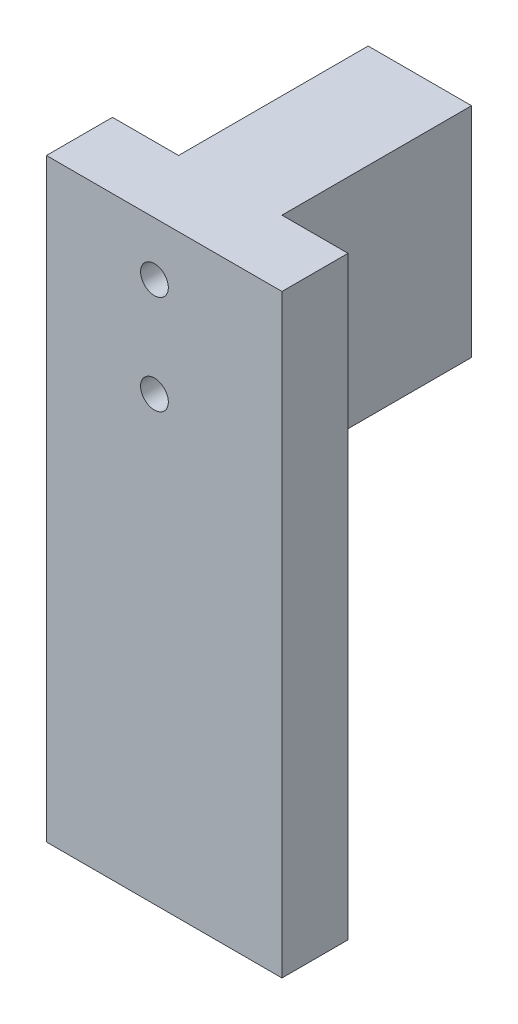
ISO-10303-21;
HEADER;
FILE_DESCRIPTION(('STEP AP214'),'2;1');
FILE_NAME('part.step','',(''),(''),'','','');
FILE_SCHEMA(('AUTOMOTIVE_DESIGN { 1 0 10303 214 1 1 1 1 }'));
ENDSEC;
DATA;
#1=APPLICATION_CONTEXT('core data for automotive mechanical design processes');
#2=APPLICATION_PROTOCOL_DEFINITION('international standard','automotive_design',2000,#1);
#3=PRODUCT_CONTEXT('',#1,'mechanical');
#4=PRODUCT('Part','Part','',(#3));
#5=PRODUCT_RELATED_PRODUCT_CATEGORY('part','',(#4));
#6=PRODUCT_DEFINITION_FORMATION('','',#4);
#7=PRODUCT_DEFINITION_CONTEXT('part definition',#1,'design');
#8=PRODUCT_DEFINITION('design','',#6,#7);
#9=PRODUCT_DEFINITION_SHAPE('','',#8);
#10=(LENGTH_UNIT() NAMED_UNIT(*) SI_UNIT(.MILLI.,.METRE.));
#11=(NAMED_UNIT(*) PLANE_ANGLE_UNIT() SI_UNIT($,.RADIAN.));
#12=(NAMED_UNIT(*) SI_UNIT($,.STERADIAN.) SOLID_ANGLE_UNIT());
#13=UNCERTAINTY_MEASURE_WITH_UNIT(LENGTH_MEASURE(1.E-05),#10,'distance_accuracy_value','');
#14=(GEOMETRIC_REPRESENTATION_CONTEXT(3) GLOBAL_UNCERTAINTY_ASSIGNED_CONTEXT((#13)) GLOBAL_UNIT_ASSIGNED_CONTEXT((#10,
#11,#12)) REPRESENTATION_CONTEXT('',''));
#15=CARTESIAN_POINT('',(0.,0.,0.));
#16=DIRECTION('',(0.,0.,1.));
#17=DIRECTION('',(1.,0.,0.));
#18=AXIS2_PLACEMENT_3D('',#15,#16,#17);
#19=CARTESIAN_POINT('',(0.,0.,0.));
#20=DIRECTION('',(0.,-1.,0.));
#21=DIRECTION('',(0.,0.,-1.));
#22=AXIS2_PLACEMENT_3D('',#19,#20,#21);
#23=PLANE('',#22);
#24=DIRECTION('',(0.,0.,1.));
#25=VECTOR('',#24,1.);
#26=CARTESIAN_POINT('',(3.04832781597487,0.,0.));
#27=LINE('',#26,#25);
#28=CARTESIAN_POINT('',(3.04832781597487,0.,-18.7));
#29=VERTEX_POINT('',#28);
#30=CARTESIAN_POINT('',(3.04832781597487,0.,-15.7));
#31=VERTEX_POINT('',#30);
#32=EDGE_CURVE('E193',#29,#31,#27,.T.);
#33=ORIENTED_EDGE('',*,*,#32,.F.);
#34=DIRECTION('',(-1.,0.,0.));
#35=VECTOR('',#34,1.);
#36=CARTESIAN_POINT('',(18.7,0.,-18.7));
#37=LINE('',#36,#35);
#38=CARTESIAN_POINT('',(18.7,0.,-18.7));
#39=VERTEX_POINT('',#38);
#40=EDGE_CURVE('E48',#39,#29,#37,.T.);
#41=ORIENTED_EDGE('',*,*,#40,.F.);
#42=DIRECTION('',(0.,0.,-1.));
#43=VECTOR('',#42,1.);
#44=CARTESIAN_POINT('',(18.7,0.,-18.7));
#45=LINE('',#44,#43);
#46=CARTESIAN_POINT('',(18.7,0.,10.));
#47=VERTEX_POINT('',#46);
#48=EDGE_CURVE('E237',#47,#39,#45,.T.);
#49=ORIENTED_EDGE('',*,*,#48,.F.);
#50=DIRECTION('',(1.,0.,0.));
#51=VECTOR('',#50,1.);
#52=CARTESIAN_POINT('',(3.04832781597487,0.,10.));
#53=LINE('',#52,#51);
#54=CARTESIAN_POINT('',(3.04832781597487,0.,10.));
#55=VERTEX_POINT('',#54);
#56=EDGE_CURVE('E175',#55,#47,#53,.T.);
#57=ORIENTED_EDGE('',*,*,#56,.F.);
#58=CARTESIAN_POINT('',(3.04832781597487,0.,-3.));
#59=VERTEX_POINT('',#58);
#60=EDGE_CURVE('E188',#59,#55,#27,.T.);
#61=ORIENTED_EDGE('',*,*,#60,.F.);
#62=DIRECTION('',(1.,0.,0.));
#63=VECTOR('',#62,1.);
#64=CARTESIAN_POINT('',(3.,0.,-3.));
#65=LINE('',#64,#63);
#66=CARTESIAN_POINT('',(15.7,0.,-3.));
#67=VERTEX_POINT('',#66);
#68=EDGE_CURVE('E74',#59,#67,#65,.T.);
#69=ORIENTED_EDGE('',*,*,#68,.T.);
#70=DIRECTION('',(0.,0.,-1.));
#71=VECTOR('',#70,1.);
#72=CARTESIAN_POINT('',(15.7,0.,-3.));
#73=LINE('',#72,#71);
#74=CARTESIAN_POINT('',(15.7,0.,-15.7));
#75=VERTEX_POINT('',#74);
#76=EDGE_CURVE('E226',#67,#75,#73,.T.);
#77=ORIENTED_EDGE('',*,*,#76,.T.);
#78=DIRECTION('',(-1.,0.,0.));
#79=VECTOR('',#78,1.);
#80=CARTESIAN_POINT('',(3.,0.,-15.7));
#81=LINE('',#80,#79);
#82=EDGE_CURVE('E217',#75,#31,#81,.T.);
#83=ORIENTED_EDGE('',*,*,#82,.T.);
#84=EDGE_LOOP('',(#33,#41,#49,#57,#61,#69,#77,#83));
#85=FACE_BOUND('',#84,.T.);
#86=ADVANCED_FACE('F39',(#85),#23,.T.);
#87=CARTESIAN_POINT('',(18.7,30.,-18.7));
#88=DIRECTION('',(-1.,0.,0.));
#89=DIRECTION('',(0.,0.,1.));
#90=AXIS2_PLACEMENT_3D('',#87,#88,#89);
#91=PLANE('',#90);
#92=ORIENTED_EDGE('',*,*,#48,.T.);
#93=DIRECTION('',(0.,-1.,0.));
#94=VECTOR('',#93,1.);
#95=CARTESIAN_POINT('',(18.7,30.,-18.7));
#96=LINE('',#95,#94);
#97=CARTESIAN_POINT('',(18.7,33.,-18.7));
#98=VERTEX_POINT('',#97);
#99=EDGE_CURVE('E11',#98,#39,#96,.T.);
#100=ORIENTED_EDGE('',*,*,#99,.F.);
#101=DIRECTION('',(0.,0.,-1.));
#102=VECTOR('',#101,1.);
#103=CARTESIAN_POINT('',(18.7,33.,-18.7));
#104=LINE('',#103,#102);
#105=CARTESIAN_POINT('',(18.7,33.,10.));
#106=VERTEX_POINT('',#105);
#107=EDGE_CURVE('E207',#106,#98,#104,.T.);
#108=ORIENTED_EDGE('',*,*,#107,.F.);
#109=DIRECTION('',(0.,1.,0.));
#110=VECTOR('',#109,1.);
#111=CARTESIAN_POINT('',(18.7,33.,10.));
#112=LINE('',#111,#110);
#113=EDGE_CURVE('E184',#47,#106,#112,.T.);
#114=ORIENTED_EDGE('',*,*,#113,.F.);
#115=EDGE_LOOP('',(#92,#100,#108,#114));
#116=FACE_BOUND('',#115,.T.);
#117=ADVANCED_FACE('F41',(#116),#91,.F.);
#118=CARTESIAN_POINT('',(18.7,30.,-18.7));
#119=DIRECTION('',(0.,0.,1.));
#120=DIRECTION('',(1.,0.,0.));
#121=AXIS2_PLACEMENT_3D('',#118,#119,#120);
#122=PLANE('',#121);
#123=CARTESIAN_POINT('',(9.39832781597487,24.9,-18.7));
#124=DIRECTION('',(0.,0.,-1.));
#125=DIRECTION('',(-1.,0.,0.));
#126=AXIS2_PLACEMENT_3D('',#123,#124,#125);
#127=CIRCLE('',#126,2.1);
#128=CARTESIAN_POINT('',(7.29832781597488,24.9,-18.7));
#129=VERTEX_POINT('',#128);
#130=EDGE_CURVE('E293',#129,#129,#127,.T.);
#131=ORIENTED_EDGE('',*,*,#130,.F.);
#132=EDGE_LOOP('',(#131));
#133=FACE_BOUND('',#132,.T.);
#134=CARTESIAN_POINT('',(9.39832781597487,9.9,-18.7));
#135=DIRECTION('',(0.,0.,-1.));
#136=DIRECTION('',(-1.,0.,0.));
#137=AXIS2_PLACEMENT_3D('',#134,#135,#136);
#138=CIRCLE('',#137,2.1);
#139=CARTESIAN_POINT('',(7.29832781597488,9.9,-18.7));
#140=VERTEX_POINT('',#139);
#141=EDGE_CURVE('E296',#140,#140,#138,.T.);
#142=ORIENTED_EDGE('',*,*,#141,.F.);
#143=EDGE_LOOP('',(#142));
#144=FACE_BOUND('',#143,.T.);
#145=ORIENTED_EDGE('',*,*,#40,.T.);
#146=DIRECTION('',(0.,-1.,0.));
#147=VECTOR('',#146,1.);
#148=CARTESIAN_POINT('',(3.04832781597487,33.,-18.7));
#149=LINE('',#148,#147);
#150=CARTESIAN_POINT('',(3.04832781597487,33.,-18.7));
#151=VERTEX_POINT('',#150);
#152=EDGE_CURVE('E192',#151,#29,#149,.T.);
#153=ORIENTED_EDGE('',*,*,#152,.F.);
#154=DIRECTION('',(-1.,0.,0.));
#155=VECTOR('',#154,1.);
#156=CARTESIAN_POINT('',(0.,33.,-18.7));
#157=LINE('',#156,#155);
#158=EDGE_CURVE('E210',#98,#151,#157,.T.);
#159=ORIENTED_EDGE('',*,*,#158,.F.);
#160=ORIENTED_EDGE('',*,*,#99,.T.);
#161=EDGE_LOOP('',(#145,#153,#159,#160));
#162=FACE_BOUND('',#161,.T.);
#163=ADVANCED_FACE('F242',(#133,#144,#162),#122,.F.);
#164=CARTESIAN_POINT('',(3.,30.,-3.));
#165=DIRECTION('',(0.,0.,-1.));
#166=DIRECTION('',(-1.,0.,0.));
#167=AXIS2_PLACEMENT_3D('',#164,#165,#166);
#168=PLANE('',#167);
#169=CARTESIAN_POINT('',(9.39832781597487,24.9,-3.));
#170=DIRECTION('',(0.,0.,-1.));
#171=DIRECTION('',(-1.,0.,0.));
#172=AXIS2_PLACEMENT_3D('',#169,#170,#171);
#173=CIRCLE('',#172,2.1);
#174=CARTESIAN_POINT('',(7.29832781597488,24.9,-3.));
#175=VERTEX_POINT('',#174);
#176=EDGE_CURVE('E308',#175,#175,#173,.T.);
#177=ORIENTED_EDGE('',*,*,#176,.F.);
#178=EDGE_LOOP('',(#177));
#179=FACE_BOUND('',#178,.T.);
#180=CARTESIAN_POINT('',(9.39832781597487,9.9,-3.));
#181=DIRECTION('',(0.,0.,-1.));
#182=DIRECTION('',(-1.,0.,0.));
#183=AXIS2_PLACEMENT_3D('',#180,#181,#182);
#184=CIRCLE('',#183,2.1);
#185=CARTESIAN_POINT('',(7.29832781597488,9.9,-3.));
#186=VERTEX_POINT('',#185);
#187=EDGE_CURVE('E305',#186,#186,#184,.T.);
#188=ORIENTED_EDGE('',*,*,#187,.F.);
#189=EDGE_LOOP('',(#188));
#190=FACE_BOUND('',#189,.T.);
#191=DIRECTION('',(0.,-1.,0.));
#192=VECTOR('',#191,1.);
#193=CARTESIAN_POINT('',(3.04832781597487,30.,-3.));
#194=LINE('',#193,#192);
#195=CARTESIAN_POINT('',(3.04832781597487,30.,-3.));
#196=VERTEX_POINT('',#195);
#197=EDGE_CURVE('E204',#196,#59,#194,.T.);
#198=ORIENTED_EDGE('',*,*,#197,.F.);
#199=DIRECTION('',(1.,0.,0.));
#200=VECTOR('',#199,1.);
#201=CARTESIAN_POINT('',(3.,30.,-3.));
#202=LINE('',#201,#200);
#203=CARTESIAN_POINT('',(15.7,30.,-3.));
#204=VERTEX_POINT('',#203);
#205=EDGE_CURVE('E62',#196,#204,#202,.T.);
#206=ORIENTED_EDGE('',*,*,#205,.T.);
#207=DIRECTION('',(0.,-1.,0.));
#208=VECTOR('',#207,1.);
#209=CARTESIAN_POINT('',(15.7,30.,-3.));
#210=LINE('',#209,#208);
#211=EDGE_CURVE('E234',#204,#67,#210,.T.);
#212=ORIENTED_EDGE('',*,*,#211,.T.);
#213=ORIENTED_EDGE('',*,*,#68,.F.);
#214=EDGE_LOOP('',(#198,#206,#212,#213));
#215=FACE_BOUND('',#214,.T.);
#216=ADVANCED_FACE('F254',(#179,#190,#215),#168,.T.);
#217=CARTESIAN_POINT('',(15.7,30.,-3.));
#218=DIRECTION('',(-1.,0.,0.));
#219=DIRECTION('',(0.,0.,1.));
#220=AXIS2_PLACEMENT_3D('',#217,#218,#219);
#221=PLANE('',#220);
#222=ORIENTED_EDGE('',*,*,#76,.F.);
#223=ORIENTED_EDGE('',*,*,#211,.F.);
#224=DIRECTION('',(0.,0.,-1.));
#225=VECTOR('',#224,1.);
#226=CARTESIAN_POINT('',(15.7,30.,-3.));
#227=LINE('',#226,#225);
#228=CARTESIAN_POINT('',(15.7,30.,-15.7));
#229=VERTEX_POINT('',#228);
#230=EDGE_CURVE('E216',#204,#229,#227,.T.);
#231=ORIENTED_EDGE('',*,*,#230,.T.);
#232=DIRECTION('',(0.,-1.,0.));
#233=VECTOR('',#232,1.);
#234=CARTESIAN_POINT('',(15.7,30.,-15.7));
#235=LINE('',#234,#233);
#236=EDGE_CURVE('E223',#229,#75,#235,.T.);
#237=ORIENTED_EDGE('',*,*,#236,.T.);
#238=EDGE_LOOP('',(#222,#223,#231,#237));
#239=FACE_BOUND('',#238,.T.);
#240=ADVANCED_FACE('F259',(#239),#221,.T.);
#241=CARTESIAN_POINT('',(3.,30.,-15.7));
#242=DIRECTION('',(0.,0.,1.));
#243=DIRECTION('',(1.,0.,0.));
#244=AXIS2_PLACEMENT_3D('',#241,#242,#243);
#245=PLANE('',#244);
#246=CARTESIAN_POINT('',(9.39832781597487,24.9,-15.7));
#247=DIRECTION('',(0.,0.,1.));
#248=DIRECTION('',(1.,0.,0.));
#249=AXIS2_PLACEMENT_3D('',#246,#247,#248);
#250=CIRCLE('',#249,2.1);
#251=CARTESIAN_POINT('',(11.4983278159749,24.9,-15.7));
#252=VERTEX_POINT('',#251);
#253=EDGE_CURVE('E300',#252,#252,#250,.T.);
#254=ORIENTED_EDGE('',*,*,#253,.F.);
#255=EDGE_LOOP('',(#254));
#256=FACE_BOUND('',#255,.T.);
#257=CARTESIAN_POINT('',(9.39832781597487,9.9,-15.7));
#258=DIRECTION('',(0.,0.,1.));
#259=DIRECTION('',(1.,0.,0.));
#260=AXIS2_PLACEMENT_3D('',#257,#258,#259);
#261=CIRCLE('',#260,2.1);
#262=CARTESIAN_POINT('',(11.4983278159749,9.9,-15.7));
#263=VERTEX_POINT('',#262);
#264=EDGE_CURVE('E315',#263,#263,#261,.T.);
#265=ORIENTED_EDGE('',*,*,#264,.F.);
#266=EDGE_LOOP('',(#265));
#267=FACE_BOUND('',#266,.T.);
#268=DIRECTION('',(0.,1.,0.));
#269=VECTOR('',#268,1.);
#270=CARTESIAN_POINT('',(3.04832781597487,30.,-15.7));
#271=LINE('',#270,#269);
#272=CARTESIAN_POINT('',(3.04832781597487,30.,-15.7));
#273=VERTEX_POINT('',#272);
#274=EDGE_CURVE('E201',#31,#273,#271,.T.);
#275=ORIENTED_EDGE('',*,*,#274,.F.);
#276=ORIENTED_EDGE('',*,*,#82,.F.);
#277=ORIENTED_EDGE('',*,*,#236,.F.);
#278=DIRECTION('',(-1.,0.,0.));
#279=VECTOR('',#278,1.);
#280=CARTESIAN_POINT('',(3.,30.,-15.7));
#281=LINE('',#280,#279);
#282=EDGE_CURVE('E80',#229,#273,#281,.T.);
#283=ORIENTED_EDGE('',*,*,#282,.T.);
#284=EDGE_LOOP('',(#275,#276,#277,#283));
#285=FACE_BOUND('',#284,.T.);
#286=ADVANCED_FACE('F263',(#256,#267,#285),#245,.T.);
#287=CARTESIAN_POINT('',(0.,30.,0.));
#288=DIRECTION('',(0.,1.,0.));
#289=DIRECTION('',(0.,0.,1.));
#290=AXIS2_PLACEMENT_3D('',#287,#288,#289);
#291=PLANE('',#290);
#292=ORIENTED_EDGE('',*,*,#205,.F.);
#293=DIRECTION('',(0.,0.,-1.));
#294=VECTOR('',#293,1.);
#295=CARTESIAN_POINT('',(3.04832781597487,30.,0.));
#296=LINE('',#295,#294);
#297=EDGE_CURVE('E198',#196,#273,#296,.T.);
#298=ORIENTED_EDGE('',*,*,#297,.T.);
#299=ORIENTED_EDGE('',*,*,#282,.F.);
#300=ORIENTED_EDGE('',*,*,#230,.F.);
#301=EDGE_LOOP('',(#292,#298,#299,#300));
#302=FACE_BOUND('',#301,.T.);
#303=ADVANCED_FACE('F255',(#302),#291,.F.);
#304=CARTESIAN_POINT('',(0.,33.,0.));
#305=DIRECTION('',(0.,1.,0.));
#306=DIRECTION('',(0.,0.,1.));
#307=AXIS2_PLACEMENT_3D('',#304,#305,#306);
#308=PLANE('',#307);
#309=DIRECTION('',(0.,0.,1.));
#310=VECTOR('',#309,1.);
#311=CARTESIAN_POINT('',(3.04832781597487,33.,0.));
#312=LINE('',#311,#310);
#313=CARTESIAN_POINT('',(3.04832781597487,33.,10.));
#314=VERTEX_POINT('',#313);
#315=EDGE_CURVE('E189',#151,#314,#312,.T.);
#316=ORIENTED_EDGE('',*,*,#315,.T.);
#317=DIRECTION('',(-1.,0.,0.));
#318=VECTOR('',#317,1.);
#319=CARTESIAN_POINT('',(-6.95167218402513,33.,10.));
#320=LINE('',#319,#318);
#321=CARTESIAN_POINT('',(-6.95167218402513,33.,10.));
#322=VERTEX_POINT('',#321);
#323=EDGE_CURVE('E250',#314,#322,#320,.T.);
#324=ORIENTED_EDGE('',*,*,#323,.T.);
#325=DIRECTION('',(0.,0.,-1.));
#326=VECTOR('',#325,1.);
#327=CARTESIAN_POINT('',(-6.95167218402513,33.,20.));
#328=LINE('',#327,#326);
#329=CARTESIAN_POINT('',(-6.95167218402513,33.,20.));
#330=VERTEX_POINT('',#329);
#331=EDGE_CURVE('E323',#330,#322,#328,.T.);
#332=ORIENTED_EDGE('',*,*,#331,.F.);
#333=DIRECTION('',(-1.,0.,0.));
#334=VECTOR('',#333,1.);
#335=CARTESIAN_POINT('',(-6.95167218402513,33.,20.));
#336=LINE('',#335,#334);
#337=CARTESIAN_POINT('',(28.7,33.,20.));
#338=VERTEX_POINT('',#337);
#339=EDGE_CURVE('E159',#338,#330,#336,.T.);
#340=ORIENTED_EDGE('',*,*,#339,.F.);
#341=DIRECTION('',(0.,0.,-1.));
#342=VECTOR('',#341,1.);
#343=CARTESIAN_POINT('',(28.7,33.,20.));
#344=LINE('',#343,#342);
#345=CARTESIAN_POINT('',(28.7,33.,10.));
#346=VERTEX_POINT('',#345);
#347=EDGE_CURVE('E177',#338,#346,#344,.T.);
#348=ORIENTED_EDGE('',*,*,#347,.T.);
#349=EDGE_CURVE('E164',#346,#106,#320,.T.);
#350=ORIENTED_EDGE('',*,*,#349,.T.);
#351=ORIENTED_EDGE('',*,*,#107,.T.);
#352=ORIENTED_EDGE('',*,*,#158,.T.);
#353=EDGE_LOOP('',(#316,#324,#332,#340,#348,#350,#351,#352));
#354=FACE_BOUND('',#353,.T.);
#355=ADVANCED_FACE('F272',(#354),#308,.T.);
#356=CARTESIAN_POINT('',(3.04832781597487,33.,0.));
#357=DIRECTION('',(1.,0.,0.));
#358=DIRECTION('',(0.,0.,-1.));
#359=AXIS2_PLACEMENT_3D('',#356,#357,#358);
#360=PLANE('',#359);
#361=ORIENTED_EDGE('',*,*,#197,.T.);
#362=ORIENTED_EDGE('',*,*,#60,.T.);
#363=DIRECTION('',(0.,-1.,0.));
#364=VECTOR('',#363,1.);
#365=CARTESIAN_POINT('',(3.04832781597487,33.,10.));
#366=LINE('',#365,#364);
#367=EDGE_CURVE('E170',#314,#55,#366,.T.);
#368=ORIENTED_EDGE('',*,*,#367,.F.);
#369=ORIENTED_EDGE('',*,*,#315,.F.);
#370=ORIENTED_EDGE('',*,*,#152,.T.);
#371=ORIENTED_EDGE('',*,*,#32,.T.);
#372=ORIENTED_EDGE('',*,*,#274,.T.);
#373=ORIENTED_EDGE('',*,*,#297,.F.);
#374=EDGE_LOOP('',(#361,#362,#368,#369,#370,#371,#372,#373));
#375=FACE_BOUND('',#374,.T.);
#376=ADVANCED_FACE('F252',(#375),#360,.F.);
#377=CARTESIAN_POINT('',(0.,0.,10.));
#378=DIRECTION('',(0.,0.,1.));
#379=DIRECTION('',(1.,0.,0.));
#380=AXIS2_PLACEMENT_3D('',#377,#378,#379);
#381=PLANE('',#380);
#382=ORIENTED_EDGE('',*,*,#323,.F.);
#383=ORIENTED_EDGE('',*,*,#367,.T.);
#384=ORIENTED_EDGE('',*,*,#56,.T.);
#385=ORIENTED_EDGE('',*,*,#113,.T.);
#386=ORIENTED_EDGE('',*,*,#349,.F.);
#387=DIRECTION('',(0.,1.,0.));
#388=VECTOR('',#387,1.);
#389=CARTESIAN_POINT('',(28.7,33.,10.));
#390=LINE('',#389,#388);
#391=CARTESIAN_POINT('',(28.7,-57.,10.));
#392=VERTEX_POINT('',#391);
#393=EDGE_CURVE('E329',#392,#346,#390,.T.);
#394=ORIENTED_EDGE('',*,*,#393,.F.);
#395=DIRECTION('',(1.,0.,0.));
#396=VECTOR('',#395,1.);
#397=CARTESIAN_POINT('',(-6.95167218402512,-57.,10.));
#398=LINE('',#397,#396);
#399=CARTESIAN_POINT('',(-6.95167218402512,-57.,10.));
#400=VERTEX_POINT('',#399);
#401=EDGE_CURVE('E326',#400,#392,#398,.T.);
#402=ORIENTED_EDGE('',*,*,#401,.F.);
#403=DIRECTION('',(0.,-1.,0.));
#404=VECTOR('',#403,1.);
#405=CARTESIAN_POINT('',(-6.95167218402513,33.,10.));
#406=LINE('',#405,#404);
#407=EDGE_CURVE('E168',#322,#400,#406,.T.);
#408=ORIENTED_EDGE('',*,*,#407,.F.);
#409=EDGE_LOOP('',(#382,#383,#384,#385,#386,#394,#402,#408));
#410=FACE_BOUND('',#409,.T.);
#411=ADVANCED_FACE('F249',(#410),#381,.F.);
#412=CARTESIAN_POINT('',(-6.95167218402513,33.,20.));
#413=DIRECTION('',(1.,0.,0.));
#414=DIRECTION('',(0.,1.,0.));
#415=AXIS2_PLACEMENT_3D('',#412,#413,#414);
#416=PLANE('',#415);
#417=ORIENTED_EDGE('',*,*,#407,.T.);
#418=DIRECTION('',(0.,0.,-1.));
#419=VECTOR('',#418,1.);
#420=CARTESIAN_POINT('',(-6.95167218402512,-57.,20.));
#421=LINE('',#420,#419);
#422=CARTESIAN_POINT('',(-6.95167218402512,-57.,20.));
#423=VERTEX_POINT('',#422);
#424=EDGE_CURVE('E146',#423,#400,#421,.T.);
#425=ORIENTED_EDGE('',*,*,#424,.F.);
#426=DIRECTION('',(0.,-1.,0.));
#427=VECTOR('',#426,1.);
#428=CARTESIAN_POINT('',(-6.95167218402513,33.,20.));
#429=LINE('',#428,#427);
#430=EDGE_CURVE('E154',#330,#423,#429,.T.);
#431=ORIENTED_EDGE('',*,*,#430,.F.);
#432=ORIENTED_EDGE('',*,*,#331,.T.);
#433=EDGE_LOOP('',(#417,#425,#431,#432));
#434=FACE_BOUND('',#433,.T.);
#435=ADVANCED_FACE('F166',(#434),#416,.F.);
#436=CARTESIAN_POINT('',(-6.95167218402512,-57.,20.));
#437=DIRECTION('',(0.,1.,0.));
#438=DIRECTION('',(0.,0.,1.));
#439=AXIS2_PLACEMENT_3D('',#436,#437,#438);
#440=PLANE('',#439);
#441=ORIENTED_EDGE('',*,*,#401,.T.);
#442=DIRECTION('',(0.,0.,-1.));
#443=VECTOR('',#442,1.);
#444=CARTESIAN_POINT('',(28.7,-57.,20.));
#445=LINE('',#444,#443);
#446=CARTESIAN_POINT('',(28.7,-57.,20.));
#447=VERTEX_POINT('',#446);
#448=EDGE_CURVE('E149',#447,#392,#445,.T.);
#449=ORIENTED_EDGE('',*,*,#448,.F.);
#450=DIRECTION('',(1.,0.,0.));
#451=VECTOR('',#450,1.);
#452=CARTESIAN_POINT('',(-6.95167218402512,-57.,20.));
#453=LINE('',#452,#451);
#454=EDGE_CURVE('E142',#423,#447,#453,.T.);
#455=ORIENTED_EDGE('',*,*,#454,.F.);
#456=ORIENTED_EDGE('',*,*,#424,.T.);
#457=EDGE_LOOP('',(#441,#449,#455,#456));
#458=FACE_BOUND('',#457,.T.);
#459=ADVANCED_FACE('F144',(#458),#440,.F.);
#460=CARTESIAN_POINT('',(28.7,33.,20.));
#461=DIRECTION('',(-1.,0.,0.));
#462=DIRECTION('',(0.,-1.,0.));
#463=AXIS2_PLACEMENT_3D('',#460,#461,#462);
#464=PLANE('',#463);
#465=ORIENTED_EDGE('',*,*,#393,.T.);
#466=ORIENTED_EDGE('',*,*,#347,.F.);
#467=DIRECTION('',(0.,1.,0.));
#468=VECTOR('',#467,1.);
#469=CARTESIAN_POINT('',(28.7,33.,20.));
#470=LINE('',#469,#468);
#471=EDGE_CURVE('E153',#447,#338,#470,.T.);
#472=ORIENTED_EDGE('',*,*,#471,.F.);
#473=ORIENTED_EDGE('',*,*,#448,.T.);
#474=EDGE_LOOP('',(#465,#466,#472,#473));
#475=FACE_BOUND('',#474,.T.);
#476=ADVANCED_FACE('F343',(#475),#464,.F.);
#477=CARTESIAN_POINT('',(0.,0.,20.));
#478=DIRECTION('',(0.,0.,1.));
#479=DIRECTION('',(1.,0.,0.));
#480=AXIS2_PLACEMENT_3D('',#477,#478,#479);
#481=PLANE('',#480);
#482=CARTESIAN_POINT('',(9.39832781597487,24.9,20.));
#483=DIRECTION('',(0.,0.,-1.));
#484=DIRECTION('',(-1.,0.,0.));
#485=AXIS2_PLACEMENT_3D('',#482,#483,#484);
#486=CIRCLE('',#485,2.1);
#487=CARTESIAN_POINT('',(7.29832781597488,24.9,20.));
#488=VERTEX_POINT('',#487);
#489=EDGE_CURVE('E433',#488,#488,#486,.T.);
#490=ORIENTED_EDGE('',*,*,#489,.T.);
#491=EDGE_LOOP('',(#490));
#492=FACE_BOUND('',#491,.T.);
#493=CARTESIAN_POINT('',(9.39832781597487,9.9,20.));
#494=DIRECTION('',(0.,0.,-1.));
#495=DIRECTION('',(-1.,0.,0.));
#496=AXIS2_PLACEMENT_3D('',#493,#494,#495);
#497=CIRCLE('',#496,2.1);
#498=CARTESIAN_POINT('',(7.29832781597488,9.9,20.));
#499=VERTEX_POINT('',#498);
#500=EDGE_CURVE('E299',#499,#499,#497,.T.);
#501=ORIENTED_EDGE('',*,*,#500,.T.);
#502=EDGE_LOOP('',(#501));
#503=FACE_BOUND('',#502,.T.);
#504=ORIENTED_EDGE('',*,*,#430,.T.);
#505=ORIENTED_EDGE('',*,*,#454,.T.);
#506=ORIENTED_EDGE('',*,*,#471,.T.);
#507=ORIENTED_EDGE('',*,*,#339,.T.);
#508=EDGE_LOOP('',(#504,#505,#506,#507));
#509=FACE_BOUND('',#508,.T.);
#510=ADVANCED_FACE('F157',(#492,#503,#509),#481,.T.);
#511=CARTESIAN_POINT('',(9.39832781597487,9.9,-18.7));
#512=DIRECTION('',(0.,0.,-1.));
#513=DIRECTION('',(-1.,0.,0.));
#514=AXIS2_PLACEMENT_3D('',#511,#512,#513);
#515=CYLINDRICAL_SURFACE('',#514,2.1);
#516=ORIENTED_EDGE('',*,*,#187,.T.);
#517=EDGE_LOOP('',(#516));
#518=FACE_BOUND('',#517,.T.);
#519=ORIENTED_EDGE('',*,*,#500,.F.);
#520=EDGE_LOOP('',(#519));
#521=FACE_BOUND('',#520,.T.);
#522=ADVANCED_FACE('F349',(#518,#521),#515,.F.);
#523=ORIENTED_EDGE('',*,*,#264,.T.);
#524=EDGE_LOOP('',(#523));
#525=FACE_BOUND('',#524,.T.);
#526=ORIENTED_EDGE('',*,*,#141,.T.);
#527=EDGE_LOOP('',(#526));
#528=FACE_BOUND('',#527,.T.);
#529=ADVANCED_FACE('F399',(#525,#528),#515,.F.);
#530=CARTESIAN_POINT('',(9.39832781597487,24.9,-18.7));
#531=DIRECTION('',(0.,0.,-1.));
#532=DIRECTION('',(-1.,0.,0.));
#533=AXIS2_PLACEMENT_3D('',#530,#531,#532);
#534=CYLINDRICAL_SURFACE('',#533,2.1);
#535=ORIENTED_EDGE('',*,*,#176,.T.);
#536=EDGE_LOOP('',(#535));
#537=FACE_BOUND('',#536,.T.);
#538=ORIENTED_EDGE('',*,*,#489,.F.);
#539=EDGE_LOOP('',(#538));
#540=FACE_BOUND('',#539,.T.);
#541=ADVANCED_FACE('F408',(#537,#540),#534,.F.);
#542=ORIENTED_EDGE('',*,*,#253,.T.);
#543=EDGE_LOOP('',(#542));
#544=FACE_BOUND('',#543,.T.);
#545=ORIENTED_EDGE('',*,*,#130,.T.);
#546=EDGE_LOOP('',(#545));
#547=FACE_BOUND('',#546,.T.);
#548=ADVANCED_FACE('F416',(#544,#547),#534,.F.);
#549=CLOSED_SHELL('',(#86,#117,#163,#216,#240,#286,#303,#355,#376,#411,#435,#459,#476,#510,#522,
#529,#541,#548));
#550=MANIFOLD_SOLID_BREP('B2',#549);
#551=ADVANCED_BREP_SHAPE_REPRESENTATION('',(#18,#550),#14);
#552=SHAPE_DEFINITION_REPRESENTATION(#9,#551);
ENDSEC;
END-ISO-10303-21;
